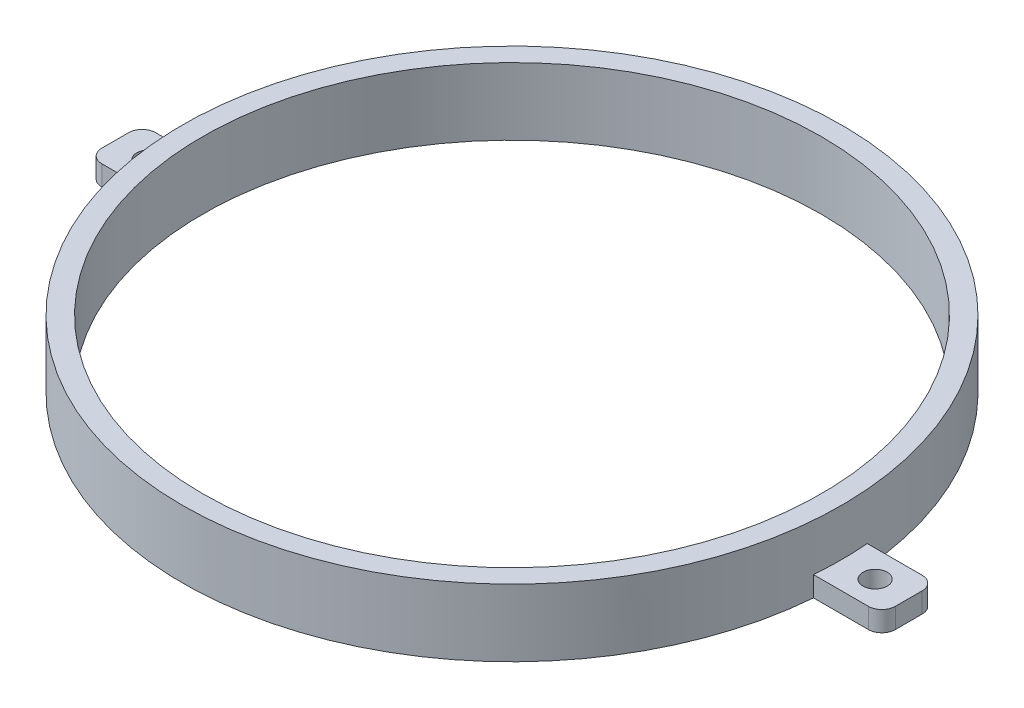
ISO-10303-21;
HEADER;
FILE_DESCRIPTION(('STEP AP214'),'2;1');
FILE_NAME('part.step','',(''),(''),'','','');
FILE_SCHEMA(('AUTOMOTIVE_DESIGN { 1 0 10303 214 1 1 1 1 }'));
ENDSEC;
DATA;
#1=APPLICATION_CONTEXT('core data for automotive mechanical design processes');
#2=APPLICATION_PROTOCOL_DEFINITION('international standard','automotive_design',2000,#1);
#3=PRODUCT_CONTEXT('',#1,'mechanical');
#4=PRODUCT('Part','Part','',(#3));
#5=PRODUCT_RELATED_PRODUCT_CATEGORY('part','',(#4));
#6=PRODUCT_DEFINITION_FORMATION('','',#4);
#7=PRODUCT_DEFINITION_CONTEXT('part definition',#1,'design');
#8=PRODUCT_DEFINITION('design','',#6,#7);
#9=PRODUCT_DEFINITION_SHAPE('','',#8);
#10=(LENGTH_UNIT() NAMED_UNIT(*) SI_UNIT(.MILLI.,.METRE.));
#11=(NAMED_UNIT(*) PLANE_ANGLE_UNIT() SI_UNIT($,.RADIAN.));
#12=(NAMED_UNIT(*) SI_UNIT($,.STERADIAN.) SOLID_ANGLE_UNIT());
#13=UNCERTAINTY_MEASURE_WITH_UNIT(LENGTH_MEASURE(1.E-05),#10,'distance_accuracy_value','');
#14=(GEOMETRIC_REPRESENTATION_CONTEXT(3) GLOBAL_UNCERTAINTY_ASSIGNED_CONTEXT((#13)) GLOBAL_UNIT_ASSIGNED_CONTEXT((#10,
#11,#12)) REPRESENTATION_CONTEXT('',''));
#15=CARTESIAN_POINT('',(0.,0.,0.));
#16=DIRECTION('',(0.,0.,1.));
#17=DIRECTION('',(1.,0.,0.));
#18=AXIS2_PLACEMENT_3D('',#15,#16,#17);
#19=CARTESIAN_POINT('',(0.,10.,0.));
#20=DIRECTION('',(0.,-1.,0.));
#21=DIRECTION('',(0.,0.,-1.));
#22=AXIS2_PLACEMENT_3D('',#19,#20,#21);
#23=CYLINDRICAL_SURFACE('',#22,49.);
#24=CARTESIAN_POINT('',(0.,0.,0.));
#25=DIRECTION('',(0.,1.,0.));
#26=DIRECTION('',(0.,0.,1.));
#27=AXIS2_PLACEMENT_3D('',#24,#25,#26);
#28=CIRCLE('',#27,49.);
#29=CARTESIAN_POINT('',(-48.8364617882991,0.,4.00000000000001));
#30=VERTEX_POINT('',#29);
#31=CARTESIAN_POINT('',(48.8364617882991,0.,4.00000000000001));
#32=VERTEX_POINT('',#31);
#33=EDGE_CURVE('E226',#30,#32,#28,.T.);
#34=ORIENTED_EDGE('',*,*,#33,.T.);
#35=DIRECTION('',(0.,-1.,0.));
#36=VECTOR('',#35,1.);
#37=CARTESIAN_POINT('',(48.8364617882991,10.,4.00000000000001));
#38=LINE('',#37,#36);
#39=CARTESIAN_POINT('',(48.8364617882991,3.,4.00000000000001));
#40=VERTEX_POINT('',#39);
#41=EDGE_CURVE('E47',#32,#40,#38,.F.);
#42=ORIENTED_EDGE('',*,*,#41,.T.);
#43=CARTESIAN_POINT('',(0.,3.,0.));
#44=DIRECTION('',(0.,-1.,0.));
#45=DIRECTION('',(0.,0.,-1.));
#46=AXIS2_PLACEMENT_3D('',#43,#44,#45);
#47=CIRCLE('',#46,49.);
#48=CARTESIAN_POINT('',(48.8364617882991,3.,-3.99999999999999));
#49=VERTEX_POINT('',#48);
#50=EDGE_CURVE('E51',#49,#40,#47,.T.);
#51=ORIENTED_EDGE('',*,*,#50,.F.);
#52=DIRECTION('',(0.,-1.,0.));
#53=VECTOR('',#52,1.);
#54=CARTESIAN_POINT('',(48.8364617882991,10.,-3.99999999999999));
#55=LINE('',#54,#53);
#56=CARTESIAN_POINT('',(48.8364617882991,0.,-3.99999999999999));
#57=VERTEX_POINT('',#56);
#58=EDGE_CURVE('E170',#49,#57,#55,.T.);
#59=ORIENTED_EDGE('',*,*,#58,.T.);
#60=CARTESIAN_POINT('',(-48.8364617882991,0.,-3.99999999999999));
#61=VERTEX_POINT('',#60);
#62=EDGE_CURVE('E220',#57,#61,#28,.T.);
#63=ORIENTED_EDGE('',*,*,#62,.T.);
#64=DIRECTION('',(0.,-1.,0.));
#65=VECTOR('',#64,1.);
#66=CARTESIAN_POINT('',(-48.8364617882991,10.,-3.99999999999999));
#67=LINE('',#66,#65);
#68=CARTESIAN_POINT('',(-48.8364617882991,3.,-3.99999999999999));
#69=VERTEX_POINT('',#68);
#70=EDGE_CURVE('E11',#69,#61,#67,.T.);
#71=ORIENTED_EDGE('',*,*,#70,.F.);
#72=CARTESIAN_POINT('',(0.,3.,0.));
#73=DIRECTION('',(0.,-1.,0.));
#74=DIRECTION('',(0.,0.,-1.));
#75=AXIS2_PLACEMENT_3D('',#72,#73,#74);
#76=CIRCLE('',#75,49.);
#77=CARTESIAN_POINT('',(-48.8364617882991,3.,4.00000000000001));
#78=VERTEX_POINT('',#77);
#79=EDGE_CURVE('E213',#78,#69,#76,.T.);
#80=ORIENTED_EDGE('',*,*,#79,.F.);
#81=DIRECTION('',(0.,-1.,0.));
#82=VECTOR('',#81,1.);
#83=CARTESIAN_POINT('',(-48.8364617882991,10.,4.00000000000001));
#84=LINE('',#83,#82);
#85=EDGE_CURVE('E40',#30,#78,#84,.F.);
#86=ORIENTED_EDGE('',*,*,#85,.F.);
#87=EDGE_LOOP('',(#34,#42,#51,#59,#63,#71,#80,#86));
#88=FACE_BOUND('',#87,.T.);
#89=CARTESIAN_POINT('',(0.,10.,0.));
#90=DIRECTION('',(0.,1.,0.));
#91=DIRECTION('',(0.,0.,1.));
#92=AXIS2_PLACEMENT_3D('',#89,#90,#91);
#93=CIRCLE('',#92,49.);
#94=CARTESIAN_POINT('',(0.,10.,49.));
#95=VERTEX_POINT('',#94);
#96=EDGE_CURVE('E223',#95,#95,#93,.T.);
#97=ORIENTED_EDGE('',*,*,#96,.F.);
#98=EDGE_LOOP('',(#97));
#99=FACE_BOUND('',#98,.T.);
#100=ADVANCED_FACE('F33',(#88,#99),#23,.T.);
#101=CARTESIAN_POINT('',(0.,10.,0.));
#102=DIRECTION('',(0.,1.,0.));
#103=DIRECTION('',(0.,0.,1.));
#104=AXIS2_PLACEMENT_3D('',#101,#102,#103);
#105=PLANE('',#104);
#106=ORIENTED_EDGE('',*,*,#96,.T.);
#107=EDGE_LOOP('',(#106));
#108=FACE_BOUND('',#107,.T.);
#109=CARTESIAN_POINT('',(0.,10.,0.));
#110=DIRECTION('',(0.,1.,0.));
#111=DIRECTION('',(0.,0.,1.));
#112=AXIS2_PLACEMENT_3D('',#109,#110,#111);
#113=CIRCLE('',#112,46.);
#114=CARTESIAN_POINT('',(0.,10.,46.));
#115=VERTEX_POINT('',#114);
#116=EDGE_CURVE('E217',#115,#115,#113,.T.);
#117=ORIENTED_EDGE('',*,*,#116,.F.);
#118=EDGE_LOOP('',(#117));
#119=FACE_BOUND('',#118,.T.);
#120=ADVANCED_FACE('F250',(#108,#119),#105,.T.);
#121=CARTESIAN_POINT('',(0.,0.,0.));
#122=DIRECTION('',(0.,1.,0.));
#123=DIRECTION('',(0.,0.,1.));
#124=AXIS2_PLACEMENT_3D('',#121,#122,#123);
#125=PLANE('',#124);
#126=ORIENTED_EDGE('',*,*,#62,.F.);
#127=DIRECTION('',(1.,0.,0.));
#128=VECTOR('',#127,1.);
#129=CARTESIAN_POINT('',(46.,0.,-3.99999999999999));
#130=LINE('',#129,#128);
#131=CARTESIAN_POINT('',(57.,0.,-3.99999999999999));
#132=VERTEX_POINT('',#131);
#133=EDGE_CURVE('E139',#57,#132,#130,.T.);
#134=ORIENTED_EDGE('',*,*,#133,.T.);
#135=CARTESIAN_POINT('',(57.,0.,-1.99999999999999));
#136=DIRECTION('',(0.,-1.,0.));
#137=DIRECTION('',(0.,0.,-1.));
#138=AXIS2_PLACEMENT_3D('',#135,#136,#137);
#139=CIRCLE('',#138,2.);
#140=CARTESIAN_POINT('',(59.,0.,-1.99999999999999));
#141=VERTEX_POINT('',#140);
#142=EDGE_CURVE('E160',#132,#141,#139,.T.);
#143=ORIENTED_EDGE('',*,*,#142,.T.);
#144=DIRECTION('',(0.,0.,1.));
#145=VECTOR('',#144,1.);
#146=CARTESIAN_POINT('',(59.,0.,-1.99999999999999));
#147=LINE('',#146,#145);
#148=CARTESIAN_POINT('',(59.,0.,2.00000000000001));
#149=VERTEX_POINT('',#148);
#150=EDGE_CURVE('E157',#141,#149,#147,.T.);
#151=ORIENTED_EDGE('',*,*,#150,.T.);
#152=CARTESIAN_POINT('',(57.,0.,2.00000000000001));
#153=DIRECTION('',(0.,-1.,0.));
#154=DIRECTION('',(0.,0.,-1.));
#155=AXIS2_PLACEMENT_3D('',#152,#153,#154);
#156=CIRCLE('',#155,2.);
#157=CARTESIAN_POINT('',(57.,0.,4.00000000000001));
#158=VERTEX_POINT('',#157);
#159=EDGE_CURVE('E154',#149,#158,#156,.T.);
#160=ORIENTED_EDGE('',*,*,#159,.T.);
#161=DIRECTION('',(-1.,0.,0.));
#162=VECTOR('',#161,1.);
#163=CARTESIAN_POINT('',(57.,0.,4.00000000000001));
#164=LINE('',#163,#162);
#165=EDGE_CURVE('E125',#158,#32,#164,.T.);
#166=ORIENTED_EDGE('',*,*,#165,.T.);
#167=ORIENTED_EDGE('',*,*,#33,.F.);
#168=DIRECTION('',(1.,0.,0.));
#169=VECTOR('',#168,1.);
#170=CARTESIAN_POINT('',(-57.,0.,4.00000000000001));
#171=LINE('',#170,#169);
#172=CARTESIAN_POINT('',(-57.,0.,4.00000000000001));
#173=VERTEX_POINT('',#172);
#174=EDGE_CURVE('E183',#173,#30,#171,.T.);
#175=ORIENTED_EDGE('',*,*,#174,.F.);
#176=CARTESIAN_POINT('',(-57.,0.,2.00000000000001));
#177=DIRECTION('',(0.,1.,0.));
#178=DIRECTION('',(0.,0.,-1.));
#179=AXIS2_PLACEMENT_3D('',#176,#177,#178);
#180=CIRCLE('',#179,2.);
#181=CARTESIAN_POINT('',(-59.,0.,2.00000000000001));
#182=VERTEX_POINT('',#181);
#183=EDGE_CURVE('E198',#182,#173,#180,.T.);
#184=ORIENTED_EDGE('',*,*,#183,.F.);
#185=DIRECTION('',(0.,0.,1.));
#186=VECTOR('',#185,1.);
#187=CARTESIAN_POINT('',(-59.,0.,-1.99999999999999));
#188=LINE('',#187,#186);
#189=CARTESIAN_POINT('',(-59.,0.,-1.99999999999999));
#190=VERTEX_POINT('',#189);
#191=EDGE_CURVE('E196',#190,#182,#188,.T.);
#192=ORIENTED_EDGE('',*,*,#191,.F.);
#193=CARTESIAN_POINT('',(-57.,0.,-1.99999999999999));
#194=DIRECTION('',(0.,1.,0.));
#195=DIRECTION('',(0.,0.,-1.));
#196=AXIS2_PLACEMENT_3D('',#193,#194,#195);
#197=CIRCLE('',#196,2.);
#198=CARTESIAN_POINT('',(-57.,0.,-3.99999999999999));
#199=VERTEX_POINT('',#198);
#200=EDGE_CURVE('E194',#199,#190,#197,.T.);
#201=ORIENTED_EDGE('',*,*,#200,.F.);
#202=DIRECTION('',(-1.,0.,0.));
#203=VECTOR('',#202,1.);
#204=CARTESIAN_POINT('',(-46.,0.,-3.99999999999999));
#205=LINE('',#204,#203);
#206=EDGE_CURVE('E177',#61,#199,#205,.T.);
#207=ORIENTED_EDGE('',*,*,#206,.F.);
#208=EDGE_LOOP('',(#126,#134,#143,#151,#160,#166,#167,#175,#184,#192,#201,#207));
#209=FACE_BOUND('',#208,.T.);
#210=CARTESIAN_POINT('',(0.,0.,0.));
#211=DIRECTION('',(0.,1.,0.));
#212=DIRECTION('',(0.,0.,1.));
#213=AXIS2_PLACEMENT_3D('',#210,#211,#212);
#214=CIRCLE('',#213,46.);
#215=CARTESIAN_POINT('',(0.,0.,46.));
#216=VERTEX_POINT('',#215);
#217=EDGE_CURVE('E216',#216,#216,#214,.T.);
#218=ORIENTED_EDGE('',*,*,#217,.T.);
#219=EDGE_LOOP('',(#218));
#220=FACE_BOUND('',#219,.T.);
#221=CARTESIAN_POINT('',(-54.,0.,0.));
#222=DIRECTION('',(0.,1.,0.));
#223=DIRECTION('',(0.,0.,1.));
#224=AXIS2_PLACEMENT_3D('',#221,#222,#223);
#225=CIRCLE('',#224,1.8);
#226=CARTESIAN_POINT('',(-54.,0.,1.80000000000001));
#227=VERTEX_POINT('',#226);
#228=EDGE_CURVE('E173',#227,#227,#225,.T.);
#229=ORIENTED_EDGE('',*,*,#228,.T.);
#230=EDGE_LOOP('',(#229));
#231=FACE_BOUND('',#230,.T.);
#232=CARTESIAN_POINT('',(54.,0.,0.));
#233=DIRECTION('',(0.,-1.,0.));
#234=DIRECTION('',(0.,0.,1.));
#235=AXIS2_PLACEMENT_3D('',#232,#233,#234);
#236=CIRCLE('',#235,1.8);
#237=CARTESIAN_POINT('',(54.,0.,1.80000000000001));
#238=VERTEX_POINT('',#237);
#239=EDGE_CURVE('E318',#238,#238,#236,.T.);
#240=ORIENTED_EDGE('',*,*,#239,.F.);
#241=EDGE_LOOP('',(#240));
#242=FACE_BOUND('',#241,.T.);
#243=ADVANCED_FACE('F245',(#209,#220,#231,#242),#125,.F.);
#244=CARTESIAN_POINT('',(0.,10.,0.));
#245=DIRECTION('',(0.,-1.,0.));
#246=DIRECTION('',(0.,0.,-1.));
#247=AXIS2_PLACEMENT_3D('',#244,#245,#246);
#248=CYLINDRICAL_SURFACE('',#247,46.);
#249=ORIENTED_EDGE('',*,*,#217,.F.);
#250=EDGE_LOOP('',(#249));
#251=FACE_BOUND('',#250,.T.);
#252=ORIENTED_EDGE('',*,*,#116,.T.);
#253=EDGE_LOOP('',(#252));
#254=FACE_BOUND('',#253,.T.);
#255=ADVANCED_FACE('F258',(#251,#254),#248,.F.);
#256=CARTESIAN_POINT('',(-46.,3.,-3.99999999999999));
#257=DIRECTION('',(0.,0.,1.));
#258=DIRECTION('',(1.,0.,0.));
#259=AXIS2_PLACEMENT_3D('',#256,#257,#258);
#260=PLANE('',#259);
#261=DIRECTION('',(-1.,0.,0.));
#262=VECTOR('',#261,1.);
#263=CARTESIAN_POINT('',(-46.,3.,-3.99999999999999));
#264=LINE('',#263,#262);
#265=CARTESIAN_POINT('',(-57.,3.,-3.99999999999999));
#266=VERTEX_POINT('',#265);
#267=EDGE_CURVE('E180',#69,#266,#264,.T.);
#268=ORIENTED_EDGE('',*,*,#267,.F.);
#269=ORIENTED_EDGE('',*,*,#70,.T.);
#270=ORIENTED_EDGE('',*,*,#206,.T.);
#271=DIRECTION('',(0.,-1.,0.));
#272=VECTOR('',#271,1.);
#273=CARTESIAN_POINT('',(-57.,3.,-3.99999999999999));
#274=LINE('',#273,#272);
#275=EDGE_CURVE('E210',#266,#199,#274,.T.);
#276=ORIENTED_EDGE('',*,*,#275,.F.);
#277=EDGE_LOOP('',(#268,#269,#270,#276));
#278=FACE_BOUND('',#277,.T.);
#279=ADVANCED_FACE('F260',(#278),#260,.F.);
#280=CARTESIAN_POINT('',(-57.,3.,4.00000000000001));
#281=DIRECTION('',(0.,0.,-1.));
#282=DIRECTION('',(-1.,0.,0.));
#283=AXIS2_PLACEMENT_3D('',#280,#281,#282);
#284=PLANE('',#283);
#285=ORIENTED_EDGE('',*,*,#174,.T.);
#286=ORIENTED_EDGE('',*,*,#85,.T.);
#287=DIRECTION('',(1.,0.,0.));
#288=VECTOR('',#287,1.);
#289=CARTESIAN_POINT('',(-57.,3.,4.00000000000001));
#290=LINE('',#289,#288);
#291=CARTESIAN_POINT('',(-57.,3.,4.00000000000001));
#292=VERTEX_POINT('',#291);
#293=EDGE_CURVE('E189',#292,#78,#290,.T.);
#294=ORIENTED_EDGE('',*,*,#293,.F.);
#295=DIRECTION('',(0.,-1.,0.));
#296=VECTOR('',#295,1.);
#297=CARTESIAN_POINT('',(-57.,3.,4.00000000000001));
#298=LINE('',#297,#296);
#299=EDGE_CURVE('E192',#292,#173,#298,.T.);
#300=ORIENTED_EDGE('',*,*,#299,.T.);
#301=EDGE_LOOP('',(#285,#286,#294,#300));
#302=FACE_BOUND('',#301,.T.);
#303=ADVANCED_FACE('F230',(#302),#284,.F.);
#304=CARTESIAN_POINT('',(-57.,3.,-1.99999999999999));
#305=DIRECTION('',(0.,-1.,0.));
#306=DIRECTION('',(0.,0.,-1.));
#307=AXIS2_PLACEMENT_3D('',#304,#305,#306);
#308=PLANE('',#307);
#309=ORIENTED_EDGE('',*,*,#293,.T.);
#310=ORIENTED_EDGE('',*,*,#79,.T.);
#311=ORIENTED_EDGE('',*,*,#267,.T.);
#312=CARTESIAN_POINT('',(-57.,3.,-1.99999999999999));
#313=DIRECTION('',(0.,1.,0.));
#314=DIRECTION('',(0.,0.,-1.));
#315=AXIS2_PLACEMENT_3D('',#312,#313,#314);
#316=CIRCLE('',#315,2.);
#317=CARTESIAN_POINT('',(-59.,3.,-1.99999999999999));
#318=VERTEX_POINT('',#317);
#319=EDGE_CURVE('E182',#266,#318,#316,.T.);
#320=ORIENTED_EDGE('',*,*,#319,.T.);
#321=DIRECTION('',(0.,0.,1.));
#322=VECTOR('',#321,1.);
#323=CARTESIAN_POINT('',(-59.,3.,-1.99999999999999));
#324=LINE('',#323,#322);
#325=CARTESIAN_POINT('',(-59.,3.,2.00000000000001));
#326=VERTEX_POINT('',#325);
#327=EDGE_CURVE('E185',#318,#326,#324,.T.);
#328=ORIENTED_EDGE('',*,*,#327,.T.);
#329=CARTESIAN_POINT('',(-57.,3.,2.00000000000001));
#330=DIRECTION('',(0.,1.,0.));
#331=DIRECTION('',(0.,0.,-1.));
#332=AXIS2_PLACEMENT_3D('',#329,#330,#331);
#333=CIRCLE('',#332,2.);
#334=EDGE_CURVE('E187',#326,#292,#333,.T.);
#335=ORIENTED_EDGE('',*,*,#334,.T.);
#336=EDGE_LOOP('',(#309,#310,#311,#320,#328,#335));
#337=FACE_BOUND('',#336,.T.);
#338=CARTESIAN_POINT('',(-54.,3.,0.));
#339=DIRECTION('',(0.,1.,0.));
#340=DIRECTION('',(0.,0.,1.));
#341=AXIS2_PLACEMENT_3D('',#338,#339,#340);
#342=CIRCLE('',#341,1.8);
#343=CARTESIAN_POINT('',(-54.,3.,1.80000000000001));
#344=VERTEX_POINT('',#343);
#345=EDGE_CURVE('E174',#344,#344,#342,.T.);
#346=ORIENTED_EDGE('',*,*,#345,.F.);
#347=EDGE_LOOP('',(#346));
#348=FACE_BOUND('',#347,.T.);
#349=ADVANCED_FACE('F234',(#337,#348),#308,.F.);
#350=CARTESIAN_POINT('',(-57.,3.,-1.99999999999999));
#351=DIRECTION('',(0.,-1.,0.));
#352=DIRECTION('',(0.,0.,-1.));
#353=AXIS2_PLACEMENT_3D('',#350,#351,#352);
#354=CYLINDRICAL_SURFACE('',#353,2.);
#355=ORIENTED_EDGE('',*,*,#200,.T.);
#356=DIRECTION('',(0.,-1.,0.));
#357=VECTOR('',#356,1.);
#358=CARTESIAN_POINT('',(-59.,3.,-1.99999999999999));
#359=LINE('',#358,#357);
#360=EDGE_CURVE('E207',#318,#190,#359,.T.);
#361=ORIENTED_EDGE('',*,*,#360,.F.);
#362=ORIENTED_EDGE('',*,*,#319,.F.);
#363=ORIENTED_EDGE('',*,*,#275,.T.);
#364=EDGE_LOOP('',(#355,#361,#362,#363));
#365=FACE_BOUND('',#364,.T.);
#366=ADVANCED_FACE('F271',(#365),#354,.T.);
#367=CARTESIAN_POINT('',(-59.,3.,-1.99999999999999));
#368=DIRECTION('',(1.,0.,0.));
#369=DIRECTION('',(0.,0.,-1.));
#370=AXIS2_PLACEMENT_3D('',#367,#368,#369);
#371=PLANE('',#370);
#372=ORIENTED_EDGE('',*,*,#191,.T.);
#373=DIRECTION('',(0.,-1.,0.));
#374=VECTOR('',#373,1.);
#375=CARTESIAN_POINT('',(-59.,3.,2.00000000000001));
#376=LINE('',#375,#374);
#377=EDGE_CURVE('E204',#326,#182,#376,.T.);
#378=ORIENTED_EDGE('',*,*,#377,.F.);
#379=ORIENTED_EDGE('',*,*,#327,.F.);
#380=ORIENTED_EDGE('',*,*,#360,.T.);
#381=EDGE_LOOP('',(#372,#378,#379,#380));
#382=FACE_BOUND('',#381,.T.);
#383=ADVANCED_FACE('F274',(#382),#371,.F.);
#384=CARTESIAN_POINT('',(-57.,3.,2.00000000000001));
#385=DIRECTION('',(0.,-1.,0.));
#386=DIRECTION('',(0.,0.,-1.));
#387=AXIS2_PLACEMENT_3D('',#384,#385,#386);
#388=CYLINDRICAL_SURFACE('',#387,2.);
#389=ORIENTED_EDGE('',*,*,#183,.T.);
#390=ORIENTED_EDGE('',*,*,#299,.F.);
#391=ORIENTED_EDGE('',*,*,#334,.F.);
#392=ORIENTED_EDGE('',*,*,#377,.T.);
#393=EDGE_LOOP('',(#389,#390,#391,#392));
#394=FACE_BOUND('',#393,.T.);
#395=ADVANCED_FACE('F242',(#394),#388,.T.);
#396=CARTESIAN_POINT('',(-54.,3.,0.));
#397=DIRECTION('',(0.,-1.,0.));
#398=DIRECTION('',(0.,0.,-1.));
#399=AXIS2_PLACEMENT_3D('',#396,#397,#398);
#400=CYLINDRICAL_SURFACE('',#399,1.8);
#401=ORIENTED_EDGE('',*,*,#345,.T.);
#402=EDGE_LOOP('',(#401));
#403=FACE_BOUND('',#402,.T.);
#404=ORIENTED_EDGE('',*,*,#228,.F.);
#405=EDGE_LOOP('',(#404));
#406=FACE_BOUND('',#405,.T.);
#407=ADVANCED_FACE('F281',(#403,#406),#400,.F.);
#408=CARTESIAN_POINT('',(57.,3.,4.00000000000001));
#409=DIRECTION('',(0.,0.,1.));
#410=DIRECTION('',(1.,0.,0.));
#411=AXIS2_PLACEMENT_3D('',#408,#409,#410);
#412=PLANE('',#411);
#413=ORIENTED_EDGE('',*,*,#41,.F.);
#414=ORIENTED_EDGE('',*,*,#165,.F.);
#415=DIRECTION('',(0.,-1.,0.));
#416=VECTOR('',#415,1.);
#417=CARTESIAN_POINT('',(57.,3.,4.00000000000001));
#418=LINE('',#417,#416);
#419=CARTESIAN_POINT('',(57.,3.,4.00000000000001));
#420=VERTEX_POINT('',#419);
#421=EDGE_CURVE('E120',#420,#158,#418,.T.);
#422=ORIENTED_EDGE('',*,*,#421,.F.);
#423=DIRECTION('',(-1.,0.,0.));
#424=VECTOR('',#423,1.);
#425=CARTESIAN_POINT('',(57.,3.,4.00000000000001));
#426=LINE('',#425,#424);
#427=EDGE_CURVE('E123',#420,#40,#426,.T.);
#428=ORIENTED_EDGE('',*,*,#427,.T.);
#429=EDGE_LOOP('',(#413,#414,#422,#428));
#430=FACE_BOUND('',#429,.T.);
#431=ADVANCED_FACE('F122',(#430),#412,.T.);
#432=CARTESIAN_POINT('',(46.,3.,-3.99999999999999));
#433=DIRECTION('',(0.,0.,-1.));
#434=DIRECTION('',(-1.,0.,0.));
#435=AXIS2_PLACEMENT_3D('',#432,#433,#434);
#436=PLANE('',#435);
#437=ORIENTED_EDGE('',*,*,#58,.F.);
#438=DIRECTION('',(1.,0.,0.));
#439=VECTOR('',#438,1.);
#440=CARTESIAN_POINT('',(46.,3.,-3.99999999999999));
#441=LINE('',#440,#439);
#442=CARTESIAN_POINT('',(57.,3.,-3.99999999999999));
#443=VERTEX_POINT('',#442);
#444=EDGE_CURVE('E150',#49,#443,#441,.T.);
#445=ORIENTED_EDGE('',*,*,#444,.T.);
#446=DIRECTION('',(0.,-1.,0.));
#447=VECTOR('',#446,1.);
#448=CARTESIAN_POINT('',(57.,3.,-3.99999999999999));
#449=LINE('',#448,#447);
#450=EDGE_CURVE('E152',#443,#132,#449,.T.);
#451=ORIENTED_EDGE('',*,*,#450,.T.);
#452=ORIENTED_EDGE('',*,*,#133,.F.);
#453=EDGE_LOOP('',(#437,#445,#451,#452));
#454=FACE_BOUND('',#453,.T.);
#455=ADVANCED_FACE('F291',(#454),#436,.T.);
#456=CARTESIAN_POINT('',(57.,3.,2.00000000000001));
#457=DIRECTION('',(0.,-1.,0.));
#458=DIRECTION('',(0.,0.,-1.));
#459=AXIS2_PLACEMENT_3D('',#456,#457,#458);
#460=CYLINDRICAL_SURFACE('',#459,2.);
#461=ORIENTED_EDGE('',*,*,#159,.F.);
#462=DIRECTION('',(0.,-1.,0.));
#463=VECTOR('',#462,1.);
#464=CARTESIAN_POINT('',(59.,3.,2.00000000000001));
#465=LINE('',#464,#463);
#466=CARTESIAN_POINT('',(59.,3.,2.00000000000001));
#467=VERTEX_POINT('',#466);
#468=EDGE_CURVE('E130',#467,#149,#465,.T.);
#469=ORIENTED_EDGE('',*,*,#468,.F.);
#470=CARTESIAN_POINT('',(57.,3.,2.00000000000001));
#471=DIRECTION('',(0.,-1.,0.));
#472=DIRECTION('',(0.,0.,-1.));
#473=AXIS2_PLACEMENT_3D('',#470,#471,#472);
#474=CIRCLE('',#473,2.);
#475=EDGE_CURVE('E137',#467,#420,#474,.T.);
#476=ORIENTED_EDGE('',*,*,#475,.T.);
#477=ORIENTED_EDGE('',*,*,#421,.T.);
#478=EDGE_LOOP('',(#461,#469,#476,#477));
#479=FACE_BOUND('',#478,.T.);
#480=ADVANCED_FACE('F141',(#479),#460,.T.);
#481=CARTESIAN_POINT('',(59.,3.,-1.99999999999999));
#482=DIRECTION('',(1.,0.,0.));
#483=DIRECTION('',(0.,0.,-1.));
#484=AXIS2_PLACEMENT_3D('',#481,#482,#483);
#485=PLANE('',#484);
#486=ORIENTED_EDGE('',*,*,#150,.F.);
#487=DIRECTION('',(0.,-1.,0.));
#488=VECTOR('',#487,1.);
#489=CARTESIAN_POINT('',(59.,3.,-1.99999999999999));
#490=LINE('',#489,#488);
#491=CARTESIAN_POINT('',(59.,3.,-1.99999999999999));
#492=VERTEX_POINT('',#491);
#493=EDGE_CURVE('E166',#492,#141,#490,.T.);
#494=ORIENTED_EDGE('',*,*,#493,.F.);
#495=DIRECTION('',(0.,0.,1.));
#496=VECTOR('',#495,1.);
#497=CARTESIAN_POINT('',(59.,3.,-1.99999999999999));
#498=LINE('',#497,#496);
#499=EDGE_CURVE('E142',#492,#467,#498,.T.);
#500=ORIENTED_EDGE('',*,*,#499,.T.);
#501=ORIENTED_EDGE('',*,*,#468,.T.);
#502=EDGE_LOOP('',(#486,#494,#500,#501));
#503=FACE_BOUND('',#502,.T.);
#504=ADVANCED_FACE('F294',(#503),#485,.T.);
#505=CARTESIAN_POINT('',(57.,3.,-1.99999999999999));
#506=DIRECTION('',(0.,-1.,0.));
#507=DIRECTION('',(0.,0.,-1.));
#508=AXIS2_PLACEMENT_3D('',#505,#506,#507);
#509=CYLINDRICAL_SURFACE('',#508,2.);
#510=ORIENTED_EDGE('',*,*,#142,.F.);
#511=ORIENTED_EDGE('',*,*,#450,.F.);
#512=CARTESIAN_POINT('',(57.,3.,-1.99999999999999));
#513=DIRECTION('',(0.,-1.,0.));
#514=DIRECTION('',(0.,0.,-1.));
#515=AXIS2_PLACEMENT_3D('',#512,#513,#514);
#516=CIRCLE('',#515,2.);
#517=EDGE_CURVE('E144',#443,#492,#516,.T.);
#518=ORIENTED_EDGE('',*,*,#517,.T.);
#519=ORIENTED_EDGE('',*,*,#493,.T.);
#520=EDGE_LOOP('',(#510,#511,#518,#519));
#521=FACE_BOUND('',#520,.T.);
#522=ADVANCED_FACE('F297',(#521),#509,.T.);
#523=CARTESIAN_POINT('',(57.,3.,-1.99999999999999));
#524=DIRECTION('',(0.,-1.,0.));
#525=DIRECTION('',(0.,0.,-1.));
#526=AXIS2_PLACEMENT_3D('',#523,#524,#525);
#527=PLANE('',#526);
#528=CARTESIAN_POINT('',(54.,3.,0.));
#529=DIRECTION('',(0.,-1.,0.));
#530=DIRECTION('',(0.,0.,1.));
#531=AXIS2_PLACEMENT_3D('',#528,#529,#530);
#532=CIRCLE('',#531,1.8);
#533=CARTESIAN_POINT('',(54.,3.,1.80000000000001));
#534=VERTEX_POINT('',#533);
#535=EDGE_CURVE('E155',#534,#534,#532,.T.);
#536=ORIENTED_EDGE('',*,*,#535,.T.);
#537=EDGE_LOOP('',(#536));
#538=FACE_BOUND('',#537,.T.);
#539=ORIENTED_EDGE('',*,*,#444,.F.);
#540=ORIENTED_EDGE('',*,*,#50,.T.);
#541=ORIENTED_EDGE('',*,*,#427,.F.);
#542=ORIENTED_EDGE('',*,*,#475,.F.);
#543=ORIENTED_EDGE('',*,*,#499,.F.);
#544=ORIENTED_EDGE('',*,*,#517,.F.);
#545=EDGE_LOOP('',(#539,#540,#541,#542,#543,#544));
#546=FACE_BOUND('',#545,.T.);
#547=ADVANCED_FACE('F135',(#538,#546),#527,.F.);
#548=CARTESIAN_POINT('',(54.,3.,0.));
#549=DIRECTION('',(0.,-1.,0.));
#550=DIRECTION('',(0.,0.,-1.));
#551=AXIS2_PLACEMENT_3D('',#548,#549,#550);
#552=CYLINDRICAL_SURFACE('',#551,1.8);
#553=ORIENTED_EDGE('',*,*,#535,.F.);
#554=EDGE_LOOP('',(#553));
#555=FACE_BOUND('',#554,.T.);
#556=ORIENTED_EDGE('',*,*,#239,.T.);
#557=EDGE_LOOP('',(#556));
#558=FACE_BOUND('',#557,.T.);
#559=ADVANCED_FACE('F307',(#555,#558),#552,.F.);
#560=CLOSED_SHELL('',(#100,#120,#243,#255,#279,#303,#349,#366,#383,#395,#407,#431,#455,#480,
#504,#522,#547,#559));
#561=MANIFOLD_SOLID_BREP('B2',#560);
#562=ADVANCED_BREP_SHAPE_REPRESENTATION('',(#18,#561),#14);
#563=SHAPE_DEFINITION_REPRESENTATION(#9,#562);
ENDSEC;
END-ISO-10303-21;
